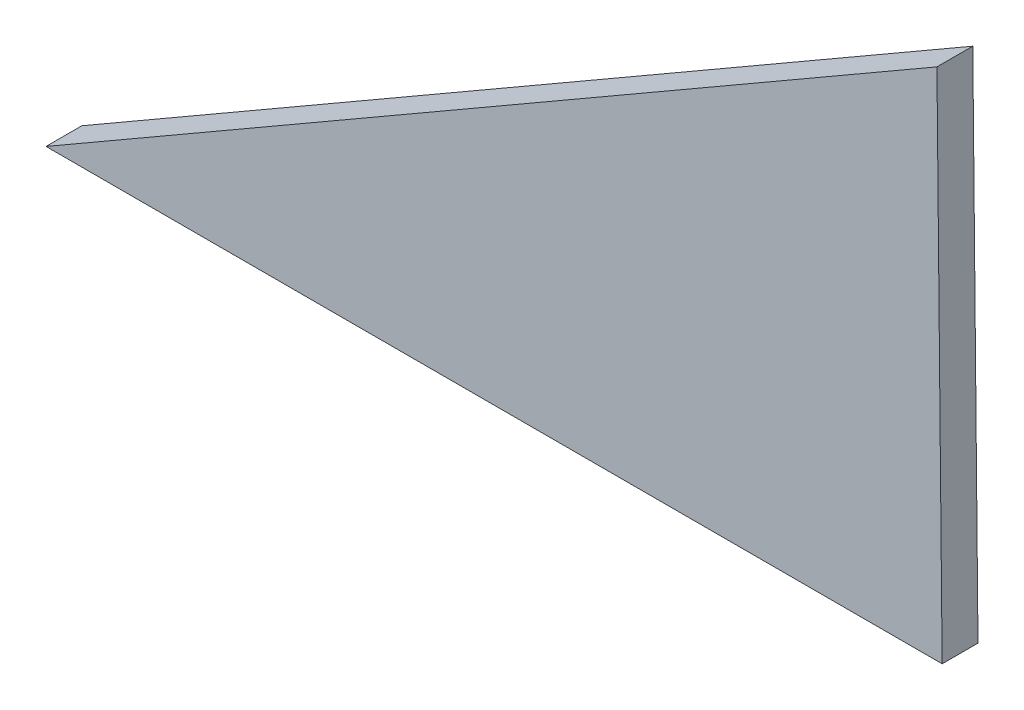
ISO-10303-21;
HEADER;
FILE_DESCRIPTION(('STEP AP214'),'2;1');
FILE_NAME('part.step','',(''),(''),'','','');
FILE_SCHEMA(('AUTOMOTIVE_DESIGN { 1 0 10303 214 1 1 1 1 }'));
ENDSEC;
DATA;
#1=APPLICATION_CONTEXT('core data for automotive mechanical design processes');
#2=APPLICATION_PROTOCOL_DEFINITION('international standard','automotive_design',2000,#1);
#3=PRODUCT_CONTEXT('',#1,'mechanical');
#4=PRODUCT('Part','Part','',(#3));
#5=PRODUCT_RELATED_PRODUCT_CATEGORY('part','',(#4));
#6=PRODUCT_DEFINITION_FORMATION('','',#4);
#7=PRODUCT_DEFINITION_CONTEXT('part definition',#1,'design');
#8=PRODUCT_DEFINITION('design','',#6,#7);
#9=PRODUCT_DEFINITION_SHAPE('','',#8);
#10=(LENGTH_UNIT() NAMED_UNIT(*) SI_UNIT(.MILLI.,.METRE.));
#11=(NAMED_UNIT(*) PLANE_ANGLE_UNIT() SI_UNIT($,.RADIAN.));
#12=(NAMED_UNIT(*) SI_UNIT($,.STERADIAN.) SOLID_ANGLE_UNIT());
#13=UNCERTAINTY_MEASURE_WITH_UNIT(LENGTH_MEASURE(1.E-05),#10,'distance_accuracy_value','');
#14=(GEOMETRIC_REPRESENTATION_CONTEXT(3) GLOBAL_UNCERTAINTY_ASSIGNED_CONTEXT((#13)) GLOBAL_UNIT_ASSIGNED_CONTEXT((#10,
#11,#12)) REPRESENTATION_CONTEXT('',''));
#15=CARTESIAN_POINT('',(0.,0.,0.));
#16=DIRECTION('',(0.,0.,1.));
#17=DIRECTION('',(1.,0.,0.));
#18=AXIS2_PLACEMENT_3D('',#15,#16,#17);
#19=CARTESIAN_POINT('',(-46.5726089733674,-38.8199527873515,4.));
#20=DIRECTION('',(0.500000000000001,-0.866025403784438,0.));
#21=DIRECTION('',(0.866025403784438,0.500000000000001,0.));
#22=AXIS2_PLACEMENT_3D('',#19,#20,#21);
#23=PLANE('',#22);
#24=DIRECTION('',(-0.866025403784438,-0.500000000000001,0.));
#25=VECTOR('',#24,1.);
#26=CARTESIAN_POINT('',(-46.5726089733674,-38.8199527873515,0.));
#27=LINE('',#26,#25);
#28=CARTESIAN_POINT('',(52.8456385696081,18.5791991939464,0.));
#29=VERTEX_POINT('',#28);
#30=CARTESIAN_POINT('',(-46.5726089733674,-38.8199527873515,0.));
#31=VERTEX_POINT('',#30);
#32=EDGE_CURVE('E89',#29,#31,#27,.T.);
#33=ORIENTED_EDGE('',*,*,#32,.T.);
#34=DIRECTION('',(0.,0.,-1.));
#35=VECTOR('',#34,1.);
#36=CARTESIAN_POINT('',(-46.5726089733674,-38.8199527873515,4.));
#37=LINE('',#36,#35);
#38=CARTESIAN_POINT('',(-46.5726089733674,-38.8199527873515,4.));
#39=VERTEX_POINT('',#38);
#40=EDGE_CURVE('E11',#39,#31,#37,.T.);
#41=ORIENTED_EDGE('',*,*,#40,.F.);
#42=DIRECTION('',(-0.866025403784438,-0.500000000000001,0.));
#43=VECTOR('',#42,1.);
#44=CARTESIAN_POINT('',(-46.5726089733674,-38.8199527873515,4.));
#45=LINE('',#44,#43);
#46=CARTESIAN_POINT('',(52.8456385696081,18.5791991939464,4.));
#47=VERTEX_POINT('',#46);
#48=EDGE_CURVE('E81',#47,#39,#45,.T.);
#49=ORIENTED_EDGE('',*,*,#48,.F.);
#50=DIRECTION('',(0.,0.,-1.));
#51=VECTOR('',#50,1.);
#52=CARTESIAN_POINT('',(52.8456385696081,18.5791991939464,4.));
#53=LINE('',#52,#51);
#54=EDGE_CURVE('E90',#47,#29,#53,.T.);
#55=ORIENTED_EDGE('',*,*,#54,.T.);
#56=EDGE_LOOP('',(#33,#41,#49,#55));
#57=FACE_BOUND('',#56,.T.);
#58=ADVANCED_FACE('F39',(#57),#23,.F.);
#59=CARTESIAN_POINT('',(-46.5726089733674,-38.8199527873515,4.));
#60=DIRECTION('',(0.,1.,0.));
#61=DIRECTION('',(0.,0.,1.));
#62=AXIS2_PLACEMENT_3D('',#59,#60,#61);
#63=PLANE('',#62);
#64=DIRECTION('',(1.,0.,0.));
#65=VECTOR('',#64,1.);
#66=CARTESIAN_POINT('',(-46.5726089733674,-38.8199527873515,0.));
#67=LINE('',#66,#65);
#68=CARTESIAN_POINT('',(53.4273910266326,-38.8199527873515,0.));
#69=VERTEX_POINT('',#68);
#70=EDGE_CURVE('E68',#31,#69,#67,.T.);
#71=ORIENTED_EDGE('',*,*,#70,.T.);
#72=DIRECTION('',(0.,0.,-1.));
#73=VECTOR('',#72,1.);
#74=CARTESIAN_POINT('',(53.4273910266326,-38.8199527873515,4.));
#75=LINE('',#74,#73);
#76=CARTESIAN_POINT('',(53.4273910266326,-38.8199527873515,4.));
#77=VERTEX_POINT('',#76);
#78=EDGE_CURVE('E48',#77,#69,#75,.T.);
#79=ORIENTED_EDGE('',*,*,#78,.F.);
#80=DIRECTION('',(1.,0.,0.));
#81=VECTOR('',#80,1.);
#82=CARTESIAN_POINT('',(-46.5726089733674,-38.8199527873515,4.));
#83=LINE('',#82,#81);
#84=EDGE_CURVE('E76',#39,#77,#83,.T.);
#85=ORIENTED_EDGE('',*,*,#84,.F.);
#86=ORIENTED_EDGE('',*,*,#40,.T.);
#87=EDGE_LOOP('',(#71,#79,#85,#86));
#88=FACE_BOUND('',#87,.T.);
#89=ADVANCED_FACE('F77',(#88),#63,.F.);
#90=CARTESIAN_POINT('',(52.8456385696081,18.5791991939464,4.));
#91=DIRECTION('',(-0.999948642716131,-0.0101346894460735,0.));
#92=DIRECTION('',(0.0101346894460735,-0.999948642716131,0.));
#93=AXIS2_PLACEMENT_3D('',#90,#91,#92);
#94=PLANE('',#93);
#95=DIRECTION('',(-0.0101346894460735,0.99994864271613,0.));
#96=VECTOR('',#95,1.);
#97=CARTESIAN_POINT('',(52.8456385696081,18.5791991939464,0.));
#98=LINE('',#97,#96);
#99=EDGE_CURVE('E73',#69,#29,#98,.T.);
#100=ORIENTED_EDGE('',*,*,#99,.T.);
#101=ORIENTED_EDGE('',*,*,#54,.F.);
#102=DIRECTION('',(-0.0101346894460735,0.99994864271613,0.));
#103=VECTOR('',#102,1.);
#104=CARTESIAN_POINT('',(52.8456385696081,18.5791991939464,4.));
#105=LINE('',#104,#103);
#106=EDGE_CURVE('E56',#77,#47,#105,.T.);
#107=ORIENTED_EDGE('',*,*,#106,.F.);
#108=ORIENTED_EDGE('',*,*,#78,.T.);
#109=EDGE_LOOP('',(#100,#101,#107,#108));
#110=FACE_BOUND('',#109,.T.);
#111=ADVANCED_FACE('F102',(#110),#94,.F.);
#112=CARTESIAN_POINT('',(0.,0.,4.));
#113=DIRECTION('',(0.,0.,-1.));
#114=DIRECTION('',(-1.,0.,0.));
#115=AXIS2_PLACEMENT_3D('',#112,#113,#114);
#116=PLANE('',#115);
#117=ORIENTED_EDGE('',*,*,#48,.T.);
#118=ORIENTED_EDGE('',*,*,#84,.T.);
#119=ORIENTED_EDGE('',*,*,#106,.T.);
#120=EDGE_LOOP('',(#117,#118,#119));
#121=FACE_BOUND('',#120,.T.);
#122=ADVANCED_FACE('F84',(#121),#116,.F.);
#123=CARTESIAN_POINT('',(0.,0.,0.));
#124=DIRECTION('',(0.,0.,-1.));
#125=DIRECTION('',(-1.,0.,0.));
#126=AXIS2_PLACEMENT_3D('',#123,#124,#125);
#127=PLANE('',#126);
#128=ORIENTED_EDGE('',*,*,#32,.F.);
#129=ORIENTED_EDGE('',*,*,#99,.F.);
#130=ORIENTED_EDGE('',*,*,#70,.F.);
#131=EDGE_LOOP('',(#128,#129,#130));
#132=FACE_BOUND('',#131,.T.);
#133=ADVANCED_FACE('F103',(#132),#127,.T.);
#134=CLOSED_SHELL('',(#58,#89,#111,#122,#133));
#135=MANIFOLD_SOLID_BREP('B2',#134);
#136=ADVANCED_BREP_SHAPE_REPRESENTATION('',(#18,#135),#14);
#137=SHAPE_DEFINITION_REPRESENTATION(#9,#136);
ENDSEC;
END-ISO-10303-21;
